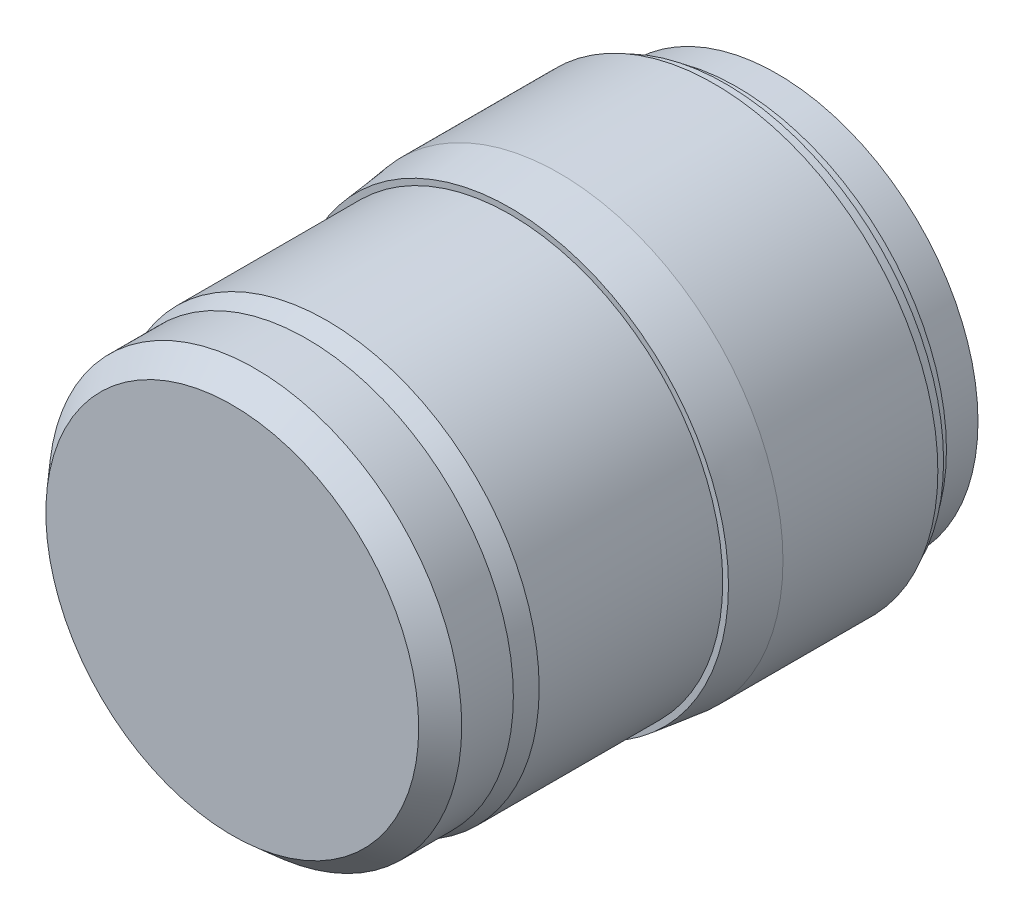
ISO-10303-21;
HEADER;
FILE_DESCRIPTION(('STEP AP214'),'2;1');
FILE_NAME('part.step','',(''),(''),'','','');
FILE_SCHEMA(('AUTOMOTIVE_DESIGN { 1 0 10303 214 1 1 1 1 }'));
ENDSEC;
DATA;
#1=APPLICATION_CONTEXT('core data for automotive mechanical design processes');
#2=APPLICATION_PROTOCOL_DEFINITION('international standard','automotive_design',2000,#1);
#3=PRODUCT_CONTEXT('',#1,'mechanical');
#4=PRODUCT('Part','Part','',(#3));
#5=PRODUCT_RELATED_PRODUCT_CATEGORY('part','',(#4));
#6=PRODUCT_DEFINITION_FORMATION('','',#4);
#7=PRODUCT_DEFINITION_CONTEXT('part definition',#1,'design');
#8=PRODUCT_DEFINITION('design','',#6,#7);
#9=PRODUCT_DEFINITION_SHAPE('','',#8);
#10=(LENGTH_UNIT() NAMED_UNIT(*) SI_UNIT(.MILLI.,.METRE.));
#11=(NAMED_UNIT(*) PLANE_ANGLE_UNIT() SI_UNIT($,.RADIAN.));
#12=(NAMED_UNIT(*) SI_UNIT($,.STERADIAN.) SOLID_ANGLE_UNIT());
#13=UNCERTAINTY_MEASURE_WITH_UNIT(LENGTH_MEASURE(1.E-05),#10,'distance_accuracy_value','');
#14=(GEOMETRIC_REPRESENTATION_CONTEXT(3) GLOBAL_UNCERTAINTY_ASSIGNED_CONTEXT((#13)) GLOBAL_UNIT_ASSIGNED_CONTEXT((#10,
#11,#12)) REPRESENTATION_CONTEXT('',''));
#15=CARTESIAN_POINT('',(0.,0.,0.));
#16=DIRECTION('',(0.,0.,1.));
#17=DIRECTION('',(1.,0.,0.));
#18=AXIS2_PLACEMENT_3D('',#15,#16,#17);
#19=CARTESIAN_POINT('',(0.,0.,-95.));
#20=DIRECTION('',(0.,0.,-1.));
#21=DIRECTION('',(-1.,0.,0.));
#22=AXIS2_PLACEMENT_3D('',#19,#20,#21);
#23=PLANE('',#22);
#24=CARTESIAN_POINT('',(0.,0.,-95.));
#25=DIRECTION('',(0.,0.,1.));
#26=DIRECTION('',(1.,0.,0.));
#27=AXIS2_PLACEMENT_3D('',#24,#25,#26);
#28=CIRCLE('',#27,35.);
#29=CARTESIAN_POINT('',(35.,0.,-95.));
#30=VERTEX_POINT('',#29);
#31=EDGE_CURVE('E10',#30,#30,#28,.T.);
#32=ORIENTED_EDGE('',*,*,#31,.F.);
#33=EDGE_LOOP('',(#32));
#34=FACE_BOUND('',#33,.T.);
#35=ADVANCED_FACE('F33',(#34),#23,.T.);
#36=CARTESIAN_POINT('',(0.,0.,0.));
#37=DIRECTION('',(0.,0.,1.));
#38=DIRECTION('',(1.,0.,0.));
#39=AXIS2_PLACEMENT_3D('',#36,#37,#38);
#40=CYLINDRICAL_SURFACE('',#39,35.);
#41=ORIENTED_EDGE('',*,*,#31,.T.);
#42=EDGE_LOOP('',(#41));
#43=FACE_BOUND('',#42,.T.);
#44=CARTESIAN_POINT('',(0.,0.,-88.));
#45=DIRECTION('',(0.,0.,1.));
#46=DIRECTION('',(1.,0.,0.));
#47=AXIS2_PLACEMENT_3D('',#44,#45,#46);
#48=CIRCLE('',#47,35.);
#49=CARTESIAN_POINT('',(35.,0.,-88.));
#50=VERTEX_POINT('',#49);
#51=EDGE_CURVE('E39',#50,#50,#48,.T.);
#52=ORIENTED_EDGE('',*,*,#51,.F.);
#53=EDGE_LOOP('',(#52));
#54=FACE_BOUND('',#53,.T.);
#55=ADVANCED_FACE('F99',(#43,#54),#40,.T.);
#56=CARTESIAN_POINT('',(35.,0.,-88.));
#57=DIRECTION('',(0.,0.,-1.));
#58=DIRECTION('',(-1.,0.,0.));
#59=AXIS2_PLACEMENT_3D('',#56,#57,#58);
#60=PLANE('',#59);
#61=ORIENTED_EDGE('',*,*,#51,.T.);
#62=EDGE_LOOP('',(#61));
#63=FACE_BOUND('',#62,.T.);
#64=CARTESIAN_POINT('',(0.,0.,-88.));
#65=DIRECTION('',(0.,0.,1.));
#66=DIRECTION('',(1.,0.,0.));
#67=AXIS2_PLACEMENT_3D('',#64,#65,#66);
#68=CIRCLE('',#67,36.5);
#69=CARTESIAN_POINT('',(36.5,0.,-88.));
#70=VERTEX_POINT('',#69);
#71=EDGE_CURVE('E43',#70,#70,#68,.T.);
#72=ORIENTED_EDGE('',*,*,#71,.F.);
#73=EDGE_LOOP('',(#72));
#74=FACE_BOUND('',#73,.T.);
#75=ADVANCED_FACE('F104',(#63,#74),#60,.T.);
#76=CARTESIAN_POINT('',(0.,0.,0.));
#77=DIRECTION('',(0.,0.,1.));
#78=DIRECTION('',(1.,0.,0.));
#79=AXIS2_PLACEMENT_3D('',#76,#77,#78);
#80=CYLINDRICAL_SURFACE('',#79,36.5);
#81=ORIENTED_EDGE('',*,*,#71,.T.);
#82=EDGE_LOOP('',(#81));
#83=FACE_BOUND('',#82,.T.);
#84=CARTESIAN_POINT('',(0.,0.,-86.000977096974));
#85=DIRECTION('',(0.,0.,1.));
#86=DIRECTION('',(1.,0.,0.));
#87=AXIS2_PLACEMENT_3D('',#84,#85,#86);
#88=CIRCLE('',#87,36.5);
#89=CARTESIAN_POINT('',(36.5,0.,-86.000977096974));
#90=VERTEX_POINT('',#89);
#91=EDGE_CURVE('E47',#90,#90,#88,.T.);
#92=ORIENTED_EDGE('',*,*,#91,.F.);
#93=EDGE_LOOP('',(#92));
#94=FACE_BOUND('',#93,.T.);
#95=ADVANCED_FACE('F108',(#83,#94),#80,.T.);
#96=CARTESIAN_POINT('',(36.5,0.,-86.000977096974));
#97=DIRECTION('',(0.,0.,-1.));
#98=DIRECTION('',(-1.,0.,0.));
#99=AXIS2_PLACEMENT_3D('',#96,#97,#98);
#100=PLANE('',#99);
#101=ORIENTED_EDGE('',*,*,#91,.T.);
#102=EDGE_LOOP('',(#101));
#103=FACE_BOUND('',#102,.T.);
#104=CARTESIAN_POINT('',(0.,0.,-86.000977096974));
#105=DIRECTION('',(0.,0.,1.));
#106=DIRECTION('',(1.,0.,0.));
#107=AXIS2_PLACEMENT_3D('',#104,#105,#106);
#108=CIRCLE('',#107,38.);
#109=CARTESIAN_POINT('',(38.,0.,-86.000977096974));
#110=VERTEX_POINT('',#109);
#111=EDGE_CURVE('E52',#110,#110,#108,.T.);
#112=ORIENTED_EDGE('',*,*,#111,.F.);
#113=EDGE_LOOP('',(#112));
#114=FACE_BOUND('',#113,.T.);
#115=ADVANCED_FACE('F114',(#103,#114),#100,.T.);
#116=CARTESIAN_POINT('',(0.,0.,0.));
#117=DIRECTION('',(0.,0.,1.));
#118=DIRECTION('',(1.,0.,0.));
#119=AXIS2_PLACEMENT_3D('',#116,#117,#118);
#120=CYLINDRICAL_SURFACE('',#119,38.);
#121=ORIENTED_EDGE('',*,*,#111,.T.);
#122=EDGE_LOOP('',(#121));
#123=FACE_BOUND('',#122,.T.);
#124=CARTESIAN_POINT('',(0.,0.,-84.000977096974));
#125=DIRECTION('',(0.,0.,1.));
#126=DIRECTION('',(1.,0.,0.));
#127=AXIS2_PLACEMENT_3D('',#124,#125,#126);
#128=CIRCLE('',#127,38.);
#129=CARTESIAN_POINT('',(38.,0.,-84.000977096974));
#130=VERTEX_POINT('',#129);
#131=EDGE_CURVE('E55',#130,#130,#128,.T.);
#132=ORIENTED_EDGE('',*,*,#131,.F.);
#133=EDGE_LOOP('',(#132));
#134=FACE_BOUND('',#133,.T.);
#135=ADVANCED_FACE('F118',(#123,#134),#120,.T.);
#136=CARTESIAN_POINT('',(38.,0.,-84.000977096974));
#137=DIRECTION('',(0.,0.,-1.));
#138=DIRECTION('',(-1.,0.,0.));
#139=AXIS2_PLACEMENT_3D('',#136,#137,#138);
#140=PLANE('',#139);
#141=ORIENTED_EDGE('',*,*,#131,.T.);
#142=EDGE_LOOP('',(#141));
#143=FACE_BOUND('',#142,.T.);
#144=CARTESIAN_POINT('',(0.,0.,-84.000977096974));
#145=DIRECTION('',(0.,0.,1.));
#146=DIRECTION('',(1.,0.,0.));
#147=AXIS2_PLACEMENT_3D('',#144,#145,#146);
#148=CIRCLE('',#147,39.);
#149=CARTESIAN_POINT('',(39.,0.,-84.000977096974));
#150=VERTEX_POINT('',#149);
#151=EDGE_CURVE('E58',#150,#150,#148,.T.);
#152=ORIENTED_EDGE('',*,*,#151,.F.);
#153=EDGE_LOOP('',(#152));
#154=FACE_BOUND('',#153,.T.);
#155=ADVANCED_FACE('F122',(#143,#154),#140,.T.);
#156=CARTESIAN_POINT('',(0.,0.,0.));
#157=DIRECTION('',(0.,0.,1.));
#158=DIRECTION('',(1.,0.,0.));
#159=AXIS2_PLACEMENT_3D('',#156,#157,#158);
#160=CYLINDRICAL_SURFACE('',#159,39.);
#161=ORIENTED_EDGE('',*,*,#151,.T.);
#162=EDGE_LOOP('',(#161));
#163=FACE_BOUND('',#162,.T.);
#164=CARTESIAN_POINT('',(0.,0.,-57.000977096974));
#165=DIRECTION('',(0.,0.,1.));
#166=DIRECTION('',(1.,0.,0.));
#167=AXIS2_PLACEMENT_3D('',#164,#165,#166);
#168=CIRCLE('',#167,39.);
#169=CARTESIAN_POINT('',(39.,0.,-57.000977096974));
#170=VERTEX_POINT('',#169);
#171=EDGE_CURVE('E61',#170,#170,#168,.T.);
#172=ORIENTED_EDGE('',*,*,#171,.F.);
#173=EDGE_LOOP('',(#172));
#174=FACE_BOUND('',#173,.T.);
#175=ADVANCED_FACE('F126',(#163,#174),#160,.T.);
#176=CARTESIAN_POINT('',(0.,0.,-48.500977096974));
#177=DIRECTION('',(0.,0.,-1.));
#178=DIRECTION('',(-1.,0.,0.));
#179=AXIS2_PLACEMENT_3D('',#176,#177,#178);
#180=CONICAL_SURFACE('',#179,38.,0.117108744566865);
#181=ORIENTED_EDGE('',*,*,#171,.T.);
#182=EDGE_LOOP('',(#181));
#183=FACE_BOUND('',#182,.T.);
#184=CARTESIAN_POINT('',(0.,0.,-48.500977096974));
#185=DIRECTION('',(0.,0.,1.));
#186=DIRECTION('',(1.,0.,0.));
#187=AXIS2_PLACEMENT_3D('',#184,#185,#186);
#188=CIRCLE('',#187,38.);
#189=CARTESIAN_POINT('',(38.,0.,-48.500977096974));
#190=VERTEX_POINT('',#189);
#191=EDGE_CURVE('E64',#190,#190,#188,.T.);
#192=ORIENTED_EDGE('',*,*,#191,.F.);
#193=EDGE_LOOP('',(#192));
#194=FACE_BOUND('',#193,.T.);
#195=ADVANCED_FACE('F130',(#183,#194),#180,.T.);
#196=CARTESIAN_POINT('',(38.,0.,-48.500977096974));
#197=DIRECTION('',(0.,0.,1.));
#198=DIRECTION('',(1.,0.,0.));
#199=AXIS2_PLACEMENT_3D('',#196,#197,#198);
#200=PLANE('',#199);
#201=ORIENTED_EDGE('',*,*,#191,.T.);
#202=EDGE_LOOP('',(#201));
#203=FACE_BOUND('',#202,.T.);
#204=CARTESIAN_POINT('',(0.,0.,-48.500977096974));
#205=DIRECTION('',(0.,0.,1.));
#206=DIRECTION('',(1.,0.,0.));
#207=AXIS2_PLACEMENT_3D('',#204,#205,#206);
#208=CIRCLE('',#207,37.);
#209=CARTESIAN_POINT('',(37.,0.,-48.500977096974));
#210=VERTEX_POINT('',#209);
#211=EDGE_CURVE('E67',#210,#210,#208,.T.);
#212=ORIENTED_EDGE('',*,*,#211,.F.);
#213=EDGE_LOOP('',(#212));
#214=FACE_BOUND('',#213,.T.);
#215=ADVANCED_FACE('F134',(#203,#214),#200,.T.);
#216=CARTESIAN_POINT('',(0.,0.,0.));
#217=DIRECTION('',(0.,0.,1.));
#218=DIRECTION('',(1.,0.,0.));
#219=AXIS2_PLACEMENT_3D('',#216,#217,#218);
#220=CYLINDRICAL_SURFACE('',#219,37.);
#221=ORIENTED_EDGE('',*,*,#211,.T.);
#222=EDGE_LOOP('',(#221));
#223=FACE_BOUND('',#222,.T.);
#224=CARTESIAN_POINT('',(0.,0.,-16.500977096974));
#225=DIRECTION('',(0.,0.,1.));
#226=DIRECTION('',(1.,0.,0.));
#227=AXIS2_PLACEMENT_3D('',#224,#225,#226);
#228=CIRCLE('',#227,37.);
#229=CARTESIAN_POINT('',(37.,0.,-16.500977096974));
#230=VERTEX_POINT('',#229);
#231=EDGE_CURVE('E70',#230,#230,#228,.T.);
#232=ORIENTED_EDGE('',*,*,#231,.F.);
#233=EDGE_LOOP('',(#232));
#234=FACE_BOUND('',#233,.T.);
#235=ADVANCED_FACE('F138',(#223,#234),#220,.T.);
#236=CARTESIAN_POINT('',(0.,0.,-13.));
#237=DIRECTION('',(0.,0.,-1.));
#238=DIRECTION('',(-1.,0.,0.));
#239=AXIS2_PLACEMENT_3D('',#236,#237,#238);
#240=CONICAL_SURFACE('',#239,36.,0.278225934865677);
#241=ORIENTED_EDGE('',*,*,#231,.T.);
#242=EDGE_LOOP('',(#241));
#243=FACE_BOUND('',#242,.T.);
#244=CARTESIAN_POINT('',(0.,0.,-13.));
#245=DIRECTION('',(0.,0.,1.));
#246=DIRECTION('',(1.,0.,0.));
#247=AXIS2_PLACEMENT_3D('',#244,#245,#246);
#248=CIRCLE('',#247,36.);
#249=CARTESIAN_POINT('',(36.,0.,-13.));
#250=VERTEX_POINT('',#249);
#251=EDGE_CURVE('E73',#250,#250,#248,.T.);
#252=ORIENTED_EDGE('',*,*,#251,.F.);
#253=EDGE_LOOP('',(#252));
#254=FACE_BOUND('',#253,.T.);
#255=ADVANCED_FACE('F95',(#243,#254),#240,.T.);
#256=CARTESIAN_POINT('',(0.,0.,0.));
#257=DIRECTION('',(0.,0.,1.));
#258=DIRECTION('',(1.,0.,0.));
#259=AXIS2_PLACEMENT_3D('',#256,#257,#258);
#260=CYLINDRICAL_SURFACE('',#259,36.);
#261=ORIENTED_EDGE('',*,*,#251,.T.);
#262=EDGE_LOOP('',(#261));
#263=FACE_BOUND('',#262,.T.);
#264=CARTESIAN_POINT('',(0.,0.,-4.));
#265=DIRECTION('',(0.,0.,1.));
#266=DIRECTION('',(1.,0.,0.));
#267=AXIS2_PLACEMENT_3D('',#264,#265,#266);
#268=CIRCLE('',#267,36.);
#269=CARTESIAN_POINT('',(36.,0.,-4.));
#270=VERTEX_POINT('',#269);
#271=EDGE_CURVE('E76',#270,#270,#268,.T.);
#272=ORIENTED_EDGE('',*,*,#271,.F.);
#273=EDGE_LOOP('',(#272));
#274=FACE_BOUND('',#273,.T.);
#275=ADVANCED_FACE('F87',(#263,#274),#260,.T.);
#276=CARTESIAN_POINT('',(0.,0.,0.));
#277=DIRECTION('',(0.,0.,-1.));
#278=DIRECTION('',(-1.,0.,0.));
#279=AXIS2_PLACEMENT_3D('',#276,#277,#278);
#280=CONICAL_SURFACE('',#279,32.5,0.718829999621623);
#281=ORIENTED_EDGE('',*,*,#271,.T.);
#282=EDGE_LOOP('',(#281));
#283=FACE_BOUND('',#282,.T.);
#284=CARTESIAN_POINT('',(0.,0.,0.));
#285=DIRECTION('',(0.,0.,1.));
#286=DIRECTION('',(1.,0.,0.));
#287=AXIS2_PLACEMENT_3D('',#284,#285,#286);
#288=CIRCLE('',#287,32.5);
#289=CARTESIAN_POINT('',(32.5,0.,0.));
#290=VERTEX_POINT('',#289);
#291=EDGE_CURVE('E79',#290,#290,#288,.T.);
#292=ORIENTED_EDGE('',*,*,#291,.F.);
#293=EDGE_LOOP('',(#292));
#294=FACE_BOUND('',#293,.T.);
#295=ADVANCED_FACE('F85',(#283,#294),#280,.T.);
#296=CARTESIAN_POINT('',(32.5,0.,0.));
#297=DIRECTION('',(0.,0.,1.));
#298=DIRECTION('',(1.,0.,0.));
#299=AXIS2_PLACEMENT_3D('',#296,#297,#298);
#300=PLANE('',#299);
#301=ORIENTED_EDGE('',*,*,#291,.T.);
#302=EDGE_LOOP('',(#301));
#303=FACE_BOUND('',#302,.T.);
#304=ADVANCED_FACE('F83',(#303),#300,.T.);
#305=CLOSED_SHELL('',(#35,#55,#75,#95,#115,#135,#155,#175,#195,#215,#235,#255,#275,#295,#304));
#306=MANIFOLD_SOLID_BREP('B2',#305);
#307=ADVANCED_BREP_SHAPE_REPRESENTATION('',(#18,#306),#14);
#308=SHAPE_DEFINITION_REPRESENTATION(#9,#307);
ENDSEC;
END-ISO-10303-21;
